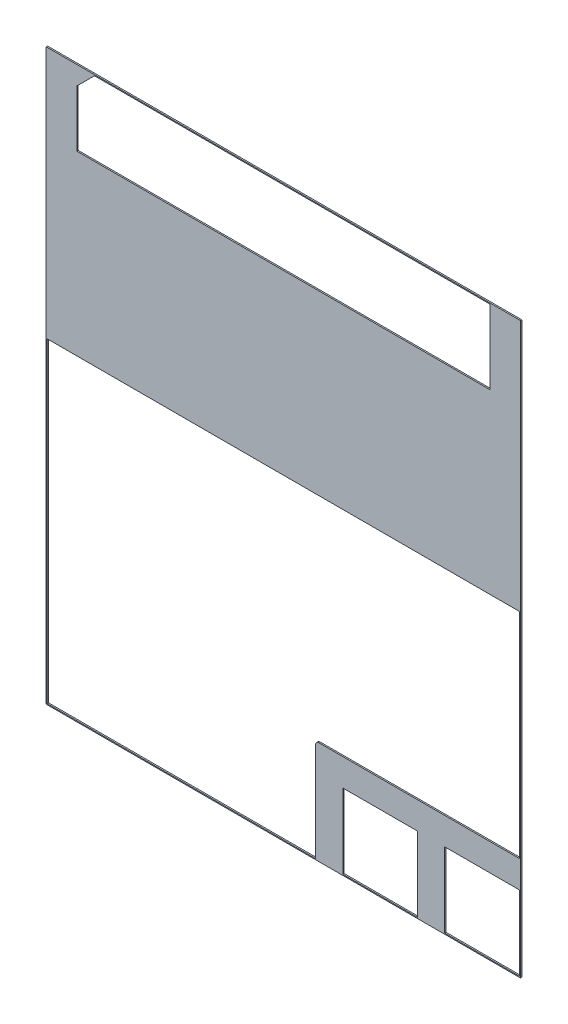
ISO-10303-21;
HEADER;
FILE_DESCRIPTION(('STEP AP214'),'2;1');
FILE_NAME('part.step','',(''),(''),'','','');
FILE_SCHEMA(('AUTOMOTIVE_DESIGN { 1 0 10303 214 1 1 1 1 }'));
ENDSEC;
DATA;
#1=APPLICATION_CONTEXT('core data for automotive mechanical design processes');
#2=APPLICATION_PROTOCOL_DEFINITION('international standard','automotive_design',2000,#1);
#3=PRODUCT_CONTEXT('',#1,'mechanical');
#4=PRODUCT('Part','Part','',(#3));
#5=PRODUCT_RELATED_PRODUCT_CATEGORY('part','',(#4));
#6=PRODUCT_DEFINITION_FORMATION('','',#4);
#7=PRODUCT_DEFINITION_CONTEXT('part definition',#1,'design');
#8=PRODUCT_DEFINITION('design','',#6,#7);
#9=PRODUCT_DEFINITION_SHAPE('','',#8);
#10=(LENGTH_UNIT() NAMED_UNIT(*) SI_UNIT(.MILLI.,.METRE.));
#11=(NAMED_UNIT(*) PLANE_ANGLE_UNIT() SI_UNIT($,.RADIAN.));
#12=(NAMED_UNIT(*) SI_UNIT($,.STERADIAN.) SOLID_ANGLE_UNIT());
#13=UNCERTAINTY_MEASURE_WITH_UNIT(LENGTH_MEASURE(1.E-05),#10,'distance_accuracy_value','');
#14=(GEOMETRIC_REPRESENTATION_CONTEXT(3) GLOBAL_UNCERTAINTY_ASSIGNED_CONTEXT((#13)) GLOBAL_UNIT_ASSIGNED_CONTEXT((#10,
#11,#12)) REPRESENTATION_CONTEXT('',''));
#15=CARTESIAN_POINT('',(0.,0.,0.));
#16=DIRECTION('',(0.,0.,1.));
#17=DIRECTION('',(1.,0.,0.));
#18=AXIS2_PLACEMENT_3D('',#15,#16,#17);
#19=CARTESIAN_POINT('',(0.,0.,0.));
#20=DIRECTION('',(0.,0.,1.));
#21=DIRECTION('',(1.,0.,0.));
#22=AXIS2_PLACEMENT_3D('',#19,#20,#21);
#23=PLANE('',#22);
#24=DIRECTION('',(0.,-1.,0.));
#25=VECTOR('',#24,1.);
#26=CARTESIAN_POINT('',(6.70499999999966,0.015,0.));
#27=LINE('',#26,#25);
#28=CARTESIAN_POINT('',(6.70499999999965,1.115,0.));
#29=VERTEX_POINT('',#28);
#30=CARTESIAN_POINT('',(6.70499999999965,0.015,0.));
#31=VERTEX_POINT('',#30);
#32=EDGE_CURVE('E324',#29,#31,#27,.T.);
#33=ORIENTED_EDGE('',*,*,#32,.F.);
#34=DIRECTION('',(1.,0.,0.));
#35=VECTOR('',#34,1.);
#36=CARTESIAN_POINT('',(6.70499999999965,1.11500000000001,0.));
#37=LINE('',#36,#35);
#38=CARTESIAN_POINT('',(5.60500000000075,1.115,0.));
#39=VERTEX_POINT('',#38);
#40=EDGE_CURVE('E310',#39,#29,#37,.T.);
#41=ORIENTED_EDGE('',*,*,#40,.F.);
#42=DIRECTION('',(0.,1.,0.));
#43=VECTOR('',#42,1.);
#44=CARTESIAN_POINT('',(5.60500000000075,1.115,0.));
#45=LINE('',#44,#43);
#46=CARTESIAN_POINT('',(5.60500000000075,0.0149999999999986,0.));
#47=VERTEX_POINT('',#46);
#48=EDGE_CURVE('E316',#47,#39,#45,.T.);
#49=ORIENTED_EDGE('',*,*,#48,.F.);
#50=DIRECTION('',(-1.,0.,0.));
#51=VECTOR('',#50,1.);
#52=CARTESIAN_POINT('',(5.60500000000075,0.0149999999999973,0.));
#53=LINE('',#52,#51);
#54=EDGE_CURVE('E321',#31,#47,#53,.T.);
#55=ORIENTED_EDGE('',*,*,#54,.F.);
#56=EDGE_LOOP('',(#33,#41,#49,#55));
#57=FACE_BOUND('',#56,.T.);
#58=DIRECTION('',(0.,-1.,0.));
#59=VECTOR('',#58,1.);
#60=CARTESIAN_POINT('',(5.20499999999942,0.015,0.));
#61=LINE('',#60,#59);
#62=CARTESIAN_POINT('',(5.2049999999994,1.115,0.));
#63=VERTEX_POINT('',#62);
#64=CARTESIAN_POINT('',(5.20499999999941,0.015,0.));
#65=VERTEX_POINT('',#64);
#66=EDGE_CURVE('E203',#63,#65,#61,.T.);
#67=ORIENTED_EDGE('',*,*,#66,.F.);
#68=DIRECTION('',(1.,0.,0.));
#69=VECTOR('',#68,1.);
#70=CARTESIAN_POINT('',(5.2049999999994,1.11500000000001,0.));
#71=LINE('',#70,#69);
#72=CARTESIAN_POINT('',(4.10500000000051,1.115,0.));
#73=VERTEX_POINT('',#72);
#74=EDGE_CURVE('E363',#73,#63,#71,.T.);
#75=ORIENTED_EDGE('',*,*,#74,.F.);
#76=DIRECTION('',(0.,1.,0.));
#77=VECTOR('',#76,1.);
#78=CARTESIAN_POINT('',(4.10500000000051,1.115,0.));
#79=LINE('',#78,#77);
#80=CARTESIAN_POINT('',(4.10500000000051,0.0149999999999986,0.));
#81=VERTEX_POINT('',#80);
#82=EDGE_CURVE('E369',#81,#73,#79,.T.);
#83=ORIENTED_EDGE('',*,*,#82,.F.);
#84=DIRECTION('',(-1.,0.,0.));
#85=VECTOR('',#84,1.);
#86=CARTESIAN_POINT('',(4.10500000000051,0.0149999999999973,0.));
#87=LINE('',#86,#85);
#88=EDGE_CURVE('E374',#65,#81,#87,.T.);
#89=ORIENTED_EDGE('',*,*,#88,.F.);
#90=EDGE_LOOP('',(#67,#75,#83,#89));
#91=FACE_BOUND('',#90,.T.);
#92=DIRECTION('',(-1.,0.,0.));
#93=VECTOR('',#92,1.);
#94=CARTESIAN_POINT('',(-0.259999999999676,0.,0.));
#95=LINE('',#94,#93);
#96=CARTESIAN_POINT('',(6.72000000107223,0.,0.));
#97=VERTEX_POINT('',#96);
#98=CARTESIAN_POINT('',(-0.259999999999676,0.,0.));
#99=VERTEX_POINT('',#98);
#100=EDGE_CURVE('E230',#97,#99,#95,.T.);
#101=ORIENTED_EDGE('',*,*,#100,.T.);
#102=DIRECTION('',(0.,1.,0.));
#103=VECTOR('',#102,1.);
#104=CARTESIAN_POINT('',(-0.259999999999676,8.38000000170986,0.));
#105=LINE('',#104,#103);
#106=CARTESIAN_POINT('',(-0.259999999999676,8.38000000170986,0.));
#107=VERTEX_POINT('',#106);
#108=EDGE_CURVE('E238',#99,#107,#105,.T.);
#109=ORIENTED_EDGE('',*,*,#108,.T.);
#110=DIRECTION('',(1.,0.,0.));
#111=VECTOR('',#110,1.);
#112=CARTESIAN_POINT('',(6.72000000107223,8.38000000170986,0.));
#113=LINE('',#112,#111);
#114=CARTESIAN_POINT('',(6.72000000107223,8.38000000170986,0.));
#115=VERTEX_POINT('',#114);
#116=EDGE_CURVE('E243',#107,#115,#113,.T.);
#117=ORIENTED_EDGE('',*,*,#116,.T.);
#118=DIRECTION('',(0.,1.,0.));
#119=VECTOR('',#118,1.);
#120=CARTESIAN_POINT('',(6.72000000107223,0.,0.));
#121=LINE('',#120,#119);
#122=EDGE_CURVE('E248',#115,#97,#121,.F.);
#123=ORIENTED_EDGE('',*,*,#122,.T.);
#124=EDGE_LOOP('',(#101,#109,#117,#123));
#125=FACE_BOUND('',#124,.T.);
#126=DIRECTION('',(1.,0.,0.));
#127=VECTOR('',#126,1.);
#128=CARTESIAN_POINT('',(3.75500000107222,1.515,0.));
#129=LINE('',#128,#127);
#130=CARTESIAN_POINT('',(6.70500000000032,1.515,0.));
#131=VERTEX_POINT('',#130);
#132=CARTESIAN_POINT('',(3.75500000107222,1.515,0.));
#133=VERTEX_POINT('',#132);
#134=EDGE_CURVE('E193',#131,#133,#129,.F.);
#135=ORIENTED_EDGE('',*,*,#134,.F.);
#136=DIRECTION('',(0.,1.,0.));
#137=VECTOR('',#136,1.);
#138=CARTESIAN_POINT('',(6.70500000000032,1.515,0.));
#139=LINE('',#138,#137);
#140=CARTESIAN_POINT('',(6.70500000000032,4.66500000150635,0.));
#141=VERTEX_POINT('',#140);
#142=EDGE_CURVE('E220',#141,#131,#139,.F.);
#143=ORIENTED_EDGE('',*,*,#142,.F.);
#144=DIRECTION('',(1.,0.,0.));
#145=VECTOR('',#144,1.);
#146=CARTESIAN_POINT('',(6.70500000000032,4.66500000150635,0.));
#147=LINE('',#146,#145);
#148=CARTESIAN_POINT('',(-0.244999999999676,4.66500000150635,0.));
#149=VERTEX_POINT('',#148);
#150=EDGE_CURVE('E258',#149,#141,#147,.T.);
#151=ORIENTED_EDGE('',*,*,#150,.F.);
#152=DIRECTION('',(0.,1.,0.));
#153=VECTOR('',#152,1.);
#154=CARTESIAN_POINT('',(-0.244999999999676,4.66500000150635,0.));
#155=LINE('',#154,#153);
#156=CARTESIAN_POINT('',(-0.244999999999676,0.0149999999999975,0.));
#157=VERTEX_POINT('',#156);
#158=EDGE_CURVE('E212',#157,#149,#155,.T.);
#159=ORIENTED_EDGE('',*,*,#158,.F.);
#160=DIRECTION('',(-1.,0.,0.));
#161=VECTOR('',#160,1.);
#162=CARTESIAN_POINT('',(-0.244999999999676,0.0149999999999973,0.));
#163=LINE('',#162,#161);
#164=CARTESIAN_POINT('',(3.70500000107223,0.015,0.));
#165=VERTEX_POINT('',#164);
#166=EDGE_CURVE('E181',#165,#157,#163,.T.);
#167=ORIENTED_EDGE('',*,*,#166,.F.);
#168=DIRECTION('',(0.,-1.,0.));
#169=VECTOR('',#168,1.);
#170=CARTESIAN_POINT('',(3.70500000107223,0.015,0.));
#171=LINE('',#170,#169);
#172=CARTESIAN_POINT('',(3.70500000107222,1.465,0.));
#173=VERTEX_POINT('',#172);
#174=EDGE_CURVE('E178',#173,#165,#171,.T.);
#175=ORIENTED_EDGE('',*,*,#174,.F.);
#176=CARTESIAN_POINT('',(3.75500000107222,1.465,0.));
#177=DIRECTION('',(0.,0.,-1.));
#178=DIRECTION('',(-1.,0.,0.));
#179=AXIS2_PLACEMENT_3D('',#176,#177,#178);
#180=CIRCLE('',#179,0.0500000000000001);
#181=EDGE_CURVE('E20',#133,#173,#180,.F.);
#182=ORIENTED_EDGE('',*,*,#181,.F.);
#183=EDGE_LOOP('',(#135,#143,#151,#159,#167,#175,#182));
#184=FACE_BOUND('',#183,.T.);
#185=DIRECTION('',(0.,1.,0.));
#186=VECTOR('',#185,1.);
#187=CARTESIAN_POINT('',(0.189999980214994,7.27500000170747,0.));
#188=LINE('',#187,#186);
#189=CARTESIAN_POINT('',(0.189999980214994,7.27500000170747,0.));
#190=VERTEX_POINT('',#189);
#191=CARTESIAN_POINT('',(0.189999980214994,8.10500000170897,0.));
#192=VERTEX_POINT('',#191);
#193=EDGE_CURVE('E354',#190,#192,#188,.T.);
#194=ORIENTED_EDGE('',*,*,#193,.F.);
#195=DIRECTION('',(1.,0.,0.));
#196=VECTOR('',#195,1.);
#197=CARTESIAN_POINT('',(6.27000002085724,7.27500000170747,0.));
#198=LINE('',#197,#196);
#199=CARTESIAN_POINT('',(6.27000002085724,7.27500000170747,0.));
#200=VERTEX_POINT('',#199);
#201=EDGE_CURVE('E333',#200,#190,#198,.F.);
#202=ORIENTED_EDGE('',*,*,#201,.F.);
#203=DIRECTION('',(0.,1.,0.));
#204=VECTOR('',#203,1.);
#205=CARTESIAN_POINT('',(6.27000002085724,8.36500000170939,0.));
#206=LINE('',#205,#204);
#207=CARTESIAN_POINT('',(6.27000002085724,8.36500000170939,0.));
#208=VERTEX_POINT('',#207);
#209=EDGE_CURVE('E339',#208,#200,#206,.F.);
#210=ORIENTED_EDGE('',*,*,#209,.F.);
#211=DIRECTION('',(1.,0.,0.));
#212=VECTOR('',#211,1.);
#213=CARTESIAN_POINT('',(0.449999980215416,8.36500000170939,0.));
#214=LINE('',#213,#212);
#215=CARTESIAN_POINT('',(0.449999980215416,8.36500000170939,0.));
#216=VERTEX_POINT('',#215);
#217=EDGE_CURVE('E345',#216,#208,#214,.T.);
#218=ORIENTED_EDGE('',*,*,#217,.F.);
#219=DIRECTION('',(0.707106781186548,0.707106781186547,0.));
#220=VECTOR('',#219,1.);
#221=CARTESIAN_POINT('',(0.189999980214994,8.10500000170897,0.));
#222=LINE('',#221,#220);
#223=EDGE_CURVE('E351',#192,#216,#222,.T.);
#224=ORIENTED_EDGE('',*,*,#223,.F.);
#225=EDGE_LOOP('',(#194,#202,#210,#218,#224));
#226=FACE_BOUND('',#225,.T.);
#227=ADVANCED_FACE('F17',(#57,#91,#125,#184,#226),#23,.F.);
#228=CARTESIAN_POINT('',(6.72000000107223,0.,0.02));
#229=DIRECTION('',(-1.,0.,0.));
#230=DIRECTION('',(0.,0.,1.));
#231=AXIS2_PLACEMENT_3D('',#228,#229,#230);
#232=PLANE('',#231);
#233=DIRECTION('',(0.,0.,-1.));
#234=VECTOR('',#233,1.);
#235=CARTESIAN_POINT('',(6.72000000107223,8.38000000170986,0.02));
#236=LINE('',#235,#234);
#237=CARTESIAN_POINT('',(6.72000000107223,8.38000000170986,0.02));
#238=VERTEX_POINT('',#237);
#239=EDGE_CURVE('E246',#115,#238,#236,.F.);
#240=ORIENTED_EDGE('',*,*,#239,.T.);
#241=DIRECTION('',(0.,1.,0.));
#242=VECTOR('',#241,1.);
#243=CARTESIAN_POINT('',(6.72000000107223,0.,0.02));
#244=LINE('',#243,#242);
#245=CARTESIAN_POINT('',(6.72000000107223,0.,0.02));
#246=VERTEX_POINT('',#245);
#247=EDGE_CURVE('E303',#246,#238,#244,.T.);
#248=ORIENTED_EDGE('',*,*,#247,.F.);
#249=DIRECTION('',(0.,0.,1.));
#250=VECTOR('',#249,1.);
#251=CARTESIAN_POINT('',(6.72000000107223,0.,0.02));
#252=LINE('',#251,#250);
#253=EDGE_CURVE('E233',#246,#97,#252,.F.);
#254=ORIENTED_EDGE('',*,*,#253,.T.);
#255=ORIENTED_EDGE('',*,*,#122,.F.);
#256=EDGE_LOOP('',(#240,#248,#254,#255));
#257=FACE_BOUND('',#256,.T.);
#258=ADVANCED_FACE('F640',(#257),#232,.F.);
#259=CARTESIAN_POINT('',(6.72000000107223,8.38000000170986,0.02));
#260=DIRECTION('',(0.,-1.,0.));
#261=DIRECTION('',(0.,0.,-1.));
#262=AXIS2_PLACEMENT_3D('',#259,#260,#261);
#263=PLANE('',#262);
#264=DIRECTION('',(0.,0.,-1.));
#265=VECTOR('',#264,1.);
#266=CARTESIAN_POINT('',(-0.259999999999676,8.38000000170986,0.02));
#267=LINE('',#266,#265);
#268=CARTESIAN_POINT('',(-0.259999999999676,8.38000000170986,0.02));
#269=VERTEX_POINT('',#268);
#270=EDGE_CURVE('E241',#107,#269,#267,.F.);
#271=ORIENTED_EDGE('',*,*,#270,.T.);
#272=DIRECTION('',(1.,0.,0.));
#273=VECTOR('',#272,1.);
#274=CARTESIAN_POINT('',(0.,8.38000000170986,0.02));
#275=LINE('',#274,#273);
#276=EDGE_CURVE('E300',#238,#269,#275,.F.);
#277=ORIENTED_EDGE('',*,*,#276,.F.);
#278=ORIENTED_EDGE('',*,*,#239,.F.);
#279=ORIENTED_EDGE('',*,*,#116,.F.);
#280=EDGE_LOOP('',(#271,#277,#278,#279));
#281=FACE_BOUND('',#280,.T.);
#282=ADVANCED_FACE('F631',(#281),#263,.F.);
#283=CARTESIAN_POINT('',(-0.259999999999676,8.38000000170986,0.02));
#284=DIRECTION('',(1.,0.,0.));
#285=DIRECTION('',(0.,0.,-1.));
#286=AXIS2_PLACEMENT_3D('',#283,#284,#285);
#287=PLANE('',#286);
#288=DIRECTION('',(0.,0.,1.));
#289=VECTOR('',#288,1.);
#290=CARTESIAN_POINT('',(-0.259999999999676,0.,0.02));
#291=LINE('',#290,#289);
#292=CARTESIAN_POINT('',(-0.259999999999676,0.,0.02));
#293=VERTEX_POINT('',#292);
#294=EDGE_CURVE('E236',#99,#293,#291,.T.);
#295=ORIENTED_EDGE('',*,*,#294,.T.);
#296=DIRECTION('',(0.,1.,0.));
#297=VECTOR('',#296,1.);
#298=CARTESIAN_POINT('',(-0.259999999999676,0.,0.02));
#299=LINE('',#298,#297);
#300=EDGE_CURVE('E291',#269,#293,#299,.F.);
#301=ORIENTED_EDGE('',*,*,#300,.F.);
#302=ORIENTED_EDGE('',*,*,#270,.F.);
#303=ORIENTED_EDGE('',*,*,#108,.F.);
#304=EDGE_LOOP('',(#295,#301,#302,#303));
#305=FACE_BOUND('',#304,.T.);
#306=ADVANCED_FACE('F622',(#305),#287,.F.);
#307=CARTESIAN_POINT('',(-0.259999999999676,0.,0.02));
#308=DIRECTION('',(0.,1.,0.));
#309=DIRECTION('',(-1.,0.,0.));
#310=AXIS2_PLACEMENT_3D('',#307,#308,#309);
#311=PLANE('',#310);
#312=ORIENTED_EDGE('',*,*,#253,.F.);
#313=DIRECTION('',(1.,0.,0.));
#314=VECTOR('',#313,1.);
#315=CARTESIAN_POINT('',(0.,0.,0.02));
#316=LINE('',#315,#314);
#317=EDGE_CURVE('E288',#293,#246,#316,.T.);
#318=ORIENTED_EDGE('',*,*,#317,.F.);
#319=ORIENTED_EDGE('',*,*,#294,.F.);
#320=ORIENTED_EDGE('',*,*,#100,.F.);
#321=EDGE_LOOP('',(#312,#318,#319,#320));
#322=FACE_BOUND('',#321,.T.);
#323=ADVANCED_FACE('F614',(#322),#311,.F.);
#324=CARTESIAN_POINT('',(3.75500000107222,1.515,0.02));
#325=DIRECTION('',(0.,1.,0.));
#326=DIRECTION('',(0.,0.,1.));
#327=AXIS2_PLACEMENT_3D('',#324,#325,#326);
#328=PLANE('',#327);
#329=DIRECTION('',(1.,0.,0.));
#330=VECTOR('',#329,1.);
#331=CARTESIAN_POINT('',(0.,1.515,0.02));
#332=LINE('',#331,#330);
#333=CARTESIAN_POINT('',(6.70500000000032,1.515,0.02));
#334=VERTEX_POINT('',#333);
#335=CARTESIAN_POINT('',(3.75500000107222,1.515,0.02));
#336=VERTEX_POINT('',#335);
#337=EDGE_CURVE('E284',#334,#336,#332,.F.);
#338=ORIENTED_EDGE('',*,*,#337,.F.);
#339=DIRECTION('',(0.,0.,1.));
#340=VECTOR('',#339,1.);
#341=CARTESIAN_POINT('',(6.70500000000032,1.515,0.02));
#342=LINE('',#341,#340);
#343=EDGE_CURVE('E216',#131,#334,#342,.T.);
#344=ORIENTED_EDGE('',*,*,#343,.F.);
#345=ORIENTED_EDGE('',*,*,#134,.T.);
#346=DIRECTION('',(0.,0.,-1.));
#347=VECTOR('',#346,1.);
#348=CARTESIAN_POINT('',(3.75500000107222,1.515,0.02));
#349=LINE('',#348,#347);
#350=EDGE_CURVE('E186',#336,#133,#349,.T.);
#351=ORIENTED_EDGE('',*,*,#350,.F.);
#352=EDGE_LOOP('',(#338,#344,#345,#351));
#353=FACE_BOUND('',#352,.T.);
#354=ADVANCED_FACE('F415',(#353),#328,.T.);
#355=CARTESIAN_POINT('',(3.75500000107222,1.465,0.02));
#356=DIRECTION('',(0.,0.,-1.));
#357=DIRECTION('',(-1.,0.,0.));
#358=AXIS2_PLACEMENT_3D('',#355,#356,#357);
#359=CYLINDRICAL_SURFACE('',#358,0.0500000000000001);
#360=CARTESIAN_POINT('',(3.75500000107222,1.465,0.02));
#361=DIRECTION('',(0.,0.,-1.));
#362=DIRECTION('',(-1.,0.,0.));
#363=AXIS2_PLACEMENT_3D('',#360,#361,#362);
#364=CIRCLE('',#363,0.0500000000000001);
#365=CARTESIAN_POINT('',(3.70500000107222,1.465,0.02));
#366=VERTEX_POINT('',#365);
#367=EDGE_CURVE('E283',#336,#366,#364,.F.);
#368=ORIENTED_EDGE('',*,*,#367,.F.);
#369=ORIENTED_EDGE('',*,*,#350,.T.);
#370=ORIENTED_EDGE('',*,*,#181,.T.);
#371=DIRECTION('',(0.,0.,1.));
#372=VECTOR('',#371,1.);
#373=CARTESIAN_POINT('',(3.70500000107222,1.465,0.02));
#374=LINE('',#373,#372);
#375=EDGE_CURVE('E185',#366,#173,#374,.F.);
#376=ORIENTED_EDGE('',*,*,#375,.F.);
#377=EDGE_LOOP('',(#368,#369,#370,#376));
#378=FACE_BOUND('',#377,.T.);
#379=ADVANCED_FACE('F191',(#378),#359,.T.);
#380=CARTESIAN_POINT('',(3.70500000107223,0.015,0.02));
#381=DIRECTION('',(-1.,0.,0.));
#382=DIRECTION('',(0.,-1.,0.));
#383=AXIS2_PLACEMENT_3D('',#380,#381,#382);
#384=PLANE('',#383);
#385=DIRECTION('',(0.,1.,0.));
#386=VECTOR('',#385,1.);
#387=CARTESIAN_POINT('',(3.70500000107222,0.,0.02));
#388=LINE('',#387,#386);
#389=CARTESIAN_POINT('',(3.70500000107222,0.015,0.02));
#390=VERTEX_POINT('',#389);
#391=EDGE_CURVE('E196',#366,#390,#388,.F.);
#392=ORIENTED_EDGE('',*,*,#391,.F.);
#393=ORIENTED_EDGE('',*,*,#375,.T.);
#394=ORIENTED_EDGE('',*,*,#174,.T.);
#395=DIRECTION('',(0.,0.,1.));
#396=VECTOR('',#395,1.);
#397=CARTESIAN_POINT('',(3.70500000107223,0.015,0.02));
#398=LINE('',#397,#396);
#399=EDGE_CURVE('E199',#390,#165,#398,.F.);
#400=ORIENTED_EDGE('',*,*,#399,.F.);
#401=EDGE_LOOP('',(#392,#393,#394,#400));
#402=FACE_BOUND('',#401,.T.);
#403=ADVANCED_FACE('F194',(#402),#384,.T.);
#404=CARTESIAN_POINT('',(-0.244999999999676,0.0149999999999973,0.02));
#405=DIRECTION('',(0.,1.,0.));
#406=DIRECTION('',(-1.,0.,0.));
#407=AXIS2_PLACEMENT_3D('',#404,#405,#406);
#408=PLANE('',#407);
#409=DIRECTION('',(1.,0.,0.));
#410=VECTOR('',#409,1.);
#411=CARTESIAN_POINT('',(0.,0.015,0.02));
#412=LINE('',#411,#410);
#413=CARTESIAN_POINT('',(-0.244999999999676,0.014999999999998,0.02));
#414=VERTEX_POINT('',#413);
#415=EDGE_CURVE('E205',#390,#414,#412,.F.);
#416=ORIENTED_EDGE('',*,*,#415,.F.);
#417=ORIENTED_EDGE('',*,*,#399,.T.);
#418=ORIENTED_EDGE('',*,*,#166,.T.);
#419=DIRECTION('',(0.,0.,-1.));
#420=VECTOR('',#419,1.);
#421=CARTESIAN_POINT('',(-0.244999999999676,0.0149999999999977,0.02));
#422=LINE('',#421,#420);
#423=EDGE_CURVE('E261',#414,#157,#422,.T.);
#424=ORIENTED_EDGE('',*,*,#423,.F.);
#425=EDGE_LOOP('',(#416,#417,#418,#424));
#426=FACE_BOUND('',#425,.T.);
#427=ADVANCED_FACE('F417',(#426),#408,.T.);
#428=CARTESIAN_POINT('',(-0.244999999999676,4.66500000150635,0.02));
#429=DIRECTION('',(1.,0.,0.));
#430=DIRECTION('',(0.,0.,-1.));
#431=AXIS2_PLACEMENT_3D('',#428,#429,#430);
#432=PLANE('',#431);
#433=DIRECTION('',(0.,1.,0.));
#434=VECTOR('',#433,1.);
#435=CARTESIAN_POINT('',(-0.244999999999676,0.,0.02));
#436=LINE('',#435,#434);
#437=CARTESIAN_POINT('',(-0.244999999999676,4.66500000150635,0.02));
#438=VERTEX_POINT('',#437);
#439=EDGE_CURVE('E208',#414,#438,#436,.T.);
#440=ORIENTED_EDGE('',*,*,#439,.F.);
#441=ORIENTED_EDGE('',*,*,#423,.T.);
#442=ORIENTED_EDGE('',*,*,#158,.T.);
#443=DIRECTION('',(0.,0.,-1.));
#444=VECTOR('',#443,1.);
#445=CARTESIAN_POINT('',(-0.244999999999676,4.66500000150635,0.02));
#446=LINE('',#445,#444);
#447=EDGE_CURVE('E255',#438,#149,#446,.T.);
#448=ORIENTED_EDGE('',*,*,#447,.F.);
#449=EDGE_LOOP('',(#440,#441,#442,#448));
#450=FACE_BOUND('',#449,.T.);
#451=ADVANCED_FACE('F407',(#450),#432,.T.);
#452=CARTESIAN_POINT('',(6.70500000000032,4.66500000150635,0.02));
#453=DIRECTION('',(0.,-1.,0.));
#454=DIRECTION('',(0.,0.,-1.));
#455=AXIS2_PLACEMENT_3D('',#452,#453,#454);
#456=PLANE('',#455);
#457=DIRECTION('',(1.,0.,0.));
#458=VECTOR('',#457,1.);
#459=CARTESIAN_POINT('',(0.,4.66500000150635,0.02));
#460=LINE('',#459,#458);
#461=CARTESIAN_POINT('',(6.70500000000032,4.66500000150635,0.02));
#462=VERTEX_POINT('',#461);
#463=EDGE_CURVE('E227',#438,#462,#460,.T.);
#464=ORIENTED_EDGE('',*,*,#463,.F.);
#465=ORIENTED_EDGE('',*,*,#447,.T.);
#466=ORIENTED_EDGE('',*,*,#150,.T.);
#467=DIRECTION('',(0.,0.,1.));
#468=VECTOR('',#467,1.);
#469=CARTESIAN_POINT('',(6.70500000000032,4.66500000150635,0.02));
#470=LINE('',#469,#468);
#471=EDGE_CURVE('E219',#462,#141,#470,.F.);
#472=ORIENTED_EDGE('',*,*,#471,.F.);
#473=EDGE_LOOP('',(#464,#465,#466,#472));
#474=FACE_BOUND('',#473,.T.);
#475=ADVANCED_FACE('F409',(#474),#456,.T.);
#476=CARTESIAN_POINT('',(6.70500000000032,1.515,0.02));
#477=DIRECTION('',(-1.,0.,0.));
#478=DIRECTION('',(0.,0.,1.));
#479=AXIS2_PLACEMENT_3D('',#476,#477,#478);
#480=PLANE('',#479);
#481=DIRECTION('',(0.,1.,0.));
#482=VECTOR('',#481,1.);
#483=CARTESIAN_POINT('',(6.70500000000032,0.,0.02));
#484=LINE('',#483,#482);
#485=EDGE_CURVE('E223',#462,#334,#484,.F.);
#486=ORIENTED_EDGE('',*,*,#485,.F.);
#487=ORIENTED_EDGE('',*,*,#471,.T.);
#488=ORIENTED_EDGE('',*,*,#142,.T.);
#489=ORIENTED_EDGE('',*,*,#343,.T.);
#490=EDGE_LOOP('',(#486,#487,#488,#489));
#491=FACE_BOUND('',#490,.T.);
#492=ADVANCED_FACE('F412',(#491),#480,.T.);
#493=CARTESIAN_POINT('',(5.20499999999942,0.015,0.02));
#494=DIRECTION('',(-1.,0.,0.));
#495=DIRECTION('',(0.,-1.,0.));
#496=AXIS2_PLACEMENT_3D('',#493,#494,#495);
#497=PLANE('',#496);
#498=DIRECTION('',(0.,1.,0.));
#499=VECTOR('',#498,1.);
#500=CARTESIAN_POINT('',(5.2049999999994,0.,0.02));
#501=LINE('',#500,#499);
#502=CARTESIAN_POINT('',(5.2049999999994,1.11500000000001,0.02));
#503=VERTEX_POINT('',#502);
#504=CARTESIAN_POINT('',(5.20499999999941,0.015,0.02));
#505=VERTEX_POINT('',#504);
#506=EDGE_CURVE('E226',#503,#505,#501,.F.);
#507=ORIENTED_EDGE('',*,*,#506,.F.);
#508=DIRECTION('',(0.,0.,1.));
#509=VECTOR('',#508,1.);
#510=CARTESIAN_POINT('',(5.2049999999994,1.11500000000001,0.02));
#511=LINE('',#510,#509);
#512=EDGE_CURVE('E360',#63,#503,#511,.T.);
#513=ORIENTED_EDGE('',*,*,#512,.F.);
#514=ORIENTED_EDGE('',*,*,#66,.T.);
#515=DIRECTION('',(0.,0.,1.));
#516=VECTOR('',#515,1.);
#517=CARTESIAN_POINT('',(5.20499999999942,0.015,0.02));
#518=LINE('',#517,#516);
#519=EDGE_CURVE('E372',#505,#65,#518,.F.);
#520=ORIENTED_EDGE('',*,*,#519,.F.);
#521=EDGE_LOOP('',(#507,#513,#514,#520));
#522=FACE_BOUND('',#521,.T.);
#523=ADVANCED_FACE('F380',(#522),#497,.T.);
#524=CARTESIAN_POINT('',(4.10500000000051,0.0149999999999973,0.02));
#525=DIRECTION('',(0.,1.,0.));
#526=DIRECTION('',(-1.,0.,0.));
#527=AXIS2_PLACEMENT_3D('',#524,#525,#526);
#528=PLANE('',#527);
#529=DIRECTION('',(1.,0.,0.));
#530=VECTOR('',#529,1.);
#531=CARTESIAN_POINT('',(0.,0.015,0.02));
#532=LINE('',#531,#530);
#533=CARTESIAN_POINT('',(4.10500000000051,0.0149999999999979,0.02));
#534=VERTEX_POINT('',#533);
#535=EDGE_CURVE('E385',#505,#534,#532,.F.);
#536=ORIENTED_EDGE('',*,*,#535,.F.);
#537=ORIENTED_EDGE('',*,*,#519,.T.);
#538=ORIENTED_EDGE('',*,*,#88,.T.);
#539=DIRECTION('',(0.,0.,-1.));
#540=VECTOR('',#539,1.);
#541=CARTESIAN_POINT('',(4.10500000000051,0.0149999999999972,0.02));
#542=LINE('',#541,#540);
#543=EDGE_CURVE('E366',#534,#81,#542,.T.);
#544=ORIENTED_EDGE('',*,*,#543,.F.);
#545=EDGE_LOOP('',(#536,#537,#538,#544));
#546=FACE_BOUND('',#545,.T.);
#547=ADVANCED_FACE('F383',(#546),#528,.T.);
#548=CARTESIAN_POINT('',(4.10500000000051,1.115,0.02));
#549=DIRECTION('',(1.,0.,0.));
#550=DIRECTION('',(0.,0.,-1.));
#551=AXIS2_PLACEMENT_3D('',#548,#549,#550);
#552=PLANE('',#551);
#553=DIRECTION('',(0.,1.,0.));
#554=VECTOR('',#553,1.);
#555=CARTESIAN_POINT('',(4.10500000000051,0.,0.02));
#556=LINE('',#555,#554);
#557=CARTESIAN_POINT('',(4.10500000000051,1.115,0.02));
#558=VERTEX_POINT('',#557);
#559=EDGE_CURVE('E390',#534,#558,#556,.T.);
#560=ORIENTED_EDGE('',*,*,#559,.F.);
#561=ORIENTED_EDGE('',*,*,#543,.T.);
#562=ORIENTED_EDGE('',*,*,#82,.T.);
#563=DIRECTION('',(0.,0.,1.));
#564=VECTOR('',#563,1.);
#565=CARTESIAN_POINT('',(4.10500000000051,1.115,0.02));
#566=LINE('',#565,#564);
#567=EDGE_CURVE('E357',#558,#73,#566,.F.);
#568=ORIENTED_EDGE('',*,*,#567,.F.);
#569=EDGE_LOOP('',(#560,#561,#562,#568));
#570=FACE_BOUND('',#569,.T.);
#571=ADVANCED_FACE('F473',(#570),#552,.T.);
#572=CARTESIAN_POINT('',(5.2049999999994,1.11500000000001,0.02));
#573=DIRECTION('',(0.,-1.,0.));
#574=DIRECTION('',(1.,0.,0.));
#575=AXIS2_PLACEMENT_3D('',#572,#573,#574);
#576=PLANE('',#575);
#577=DIRECTION('',(1.,0.,0.));
#578=VECTOR('',#577,1.);
#579=CARTESIAN_POINT('',(0.,1.115,0.02));
#580=LINE('',#579,#578);
#581=EDGE_CURVE('E395',#558,#503,#580,.T.);
#582=ORIENTED_EDGE('',*,*,#581,.F.);
#583=ORIENTED_EDGE('',*,*,#567,.T.);
#584=ORIENTED_EDGE('',*,*,#74,.T.);
#585=ORIENTED_EDGE('',*,*,#512,.T.);
#586=EDGE_LOOP('',(#582,#583,#584,#585));
#587=FACE_BOUND('',#586,.T.);
#588=ADVANCED_FACE('F469',(#587),#576,.T.);
#589=CARTESIAN_POINT('',(0.189999980214994,7.27500000170747,0.02));
#590=DIRECTION('',(1.,0.,0.));
#591=DIRECTION('',(0.,0.,-1.));
#592=AXIS2_PLACEMENT_3D('',#589,#590,#591);
#593=PLANE('',#592);
#594=DIRECTION('',(0.,1.,0.));
#595=VECTOR('',#594,1.);
#596=CARTESIAN_POINT('',(0.189999980214994,0.,0.02));
#597=LINE('',#596,#595);
#598=CARTESIAN_POINT('',(0.189999980214994,7.27500000170747,0.02));
#599=VERTEX_POINT('',#598);
#600=CARTESIAN_POINT('',(0.189999980214994,8.10500000170897,0.02));
#601=VERTEX_POINT('',#600);
#602=EDGE_CURVE('E701',#599,#601,#597,.T.);
#603=ORIENTED_EDGE('',*,*,#602,.F.);
#604=DIRECTION('',(0.,0.,1.));
#605=VECTOR('',#604,1.);
#606=CARTESIAN_POINT('',(0.189999980214994,7.27500000170747,0.02));
#607=LINE('',#606,#605);
#608=EDGE_CURVE('E330',#190,#599,#607,.T.);
#609=ORIENTED_EDGE('',*,*,#608,.F.);
#610=ORIENTED_EDGE('',*,*,#193,.T.);
#611=DIRECTION('',(0.,0.,1.));
#612=VECTOR('',#611,1.);
#613=CARTESIAN_POINT('',(0.189999980214994,8.10500000170897,0.02));
#614=LINE('',#613,#612);
#615=EDGE_CURVE('E348',#601,#192,#614,.F.);
#616=ORIENTED_EDGE('',*,*,#615,.F.);
#617=EDGE_LOOP('',(#603,#609,#610,#616));
#618=FACE_BOUND('',#617,.T.);
#619=ADVANCED_FACE('F465',(#618),#593,.T.);
#620=CARTESIAN_POINT('',(0.189999980214994,8.10500000170897,0.02));
#621=DIRECTION('',(0.707106781186547,-0.707106781186548,0.));
#622=DIRECTION('',(0.707106781186548,0.707106781186547,0.));
#623=AXIS2_PLACEMENT_3D('',#620,#621,#622);
#624=PLANE('',#623);
#625=DIRECTION('',(0.707106781186548,0.707106781186547,0.));
#626=VECTOR('',#625,1.);
#627=CARTESIAN_POINT('',(0.189999980214994,8.10500000170897,0.02));
#628=LINE('',#627,#626);
#629=CARTESIAN_POINT('',(0.449999980215416,8.36500000170939,0.02));
#630=VERTEX_POINT('',#629);
#631=EDGE_CURVE('E698',#601,#630,#628,.T.);
#632=ORIENTED_EDGE('',*,*,#631,.F.);
#633=ORIENTED_EDGE('',*,*,#615,.T.);
#634=ORIENTED_EDGE('',*,*,#223,.T.);
#635=DIRECTION('',(0.,0.,-1.));
#636=VECTOR('',#635,1.);
#637=CARTESIAN_POINT('',(0.449999980215416,8.36500000170939,0.02));
#638=LINE('',#637,#636);
#639=EDGE_CURVE('E342',#630,#216,#638,.T.);
#640=ORIENTED_EDGE('',*,*,#639,.F.);
#641=EDGE_LOOP('',(#632,#633,#634,#640));
#642=FACE_BOUND('',#641,.T.);
#643=ADVANCED_FACE('F461',(#642),#624,.T.);
#644=CARTESIAN_POINT('',(0.449999980215416,8.36500000170939,0.02));
#645=DIRECTION('',(0.,-1.,0.));
#646=DIRECTION('',(0.,0.,-1.));
#647=AXIS2_PLACEMENT_3D('',#644,#645,#646);
#648=PLANE('',#647);
#649=DIRECTION('',(1.,0.,0.));
#650=VECTOR('',#649,1.);
#651=CARTESIAN_POINT('',(0.,8.36500000170939,0.02));
#652=LINE('',#651,#650);
#653=CARTESIAN_POINT('',(6.27000002085724,8.36500000170939,0.02));
#654=VERTEX_POINT('',#653);
#655=EDGE_CURVE('E695',#630,#654,#652,.T.);
#656=ORIENTED_EDGE('',*,*,#655,.F.);
#657=ORIENTED_EDGE('',*,*,#639,.T.);
#658=ORIENTED_EDGE('',*,*,#217,.T.);
#659=DIRECTION('',(0.,0.,1.));
#660=VECTOR('',#659,1.);
#661=CARTESIAN_POINT('',(6.27000002085724,8.36500000170939,0.02));
#662=LINE('',#661,#660);
#663=EDGE_CURVE('E336',#654,#208,#662,.F.);
#664=ORIENTED_EDGE('',*,*,#663,.F.);
#665=EDGE_LOOP('',(#656,#657,#658,#664));
#666=FACE_BOUND('',#665,.T.);
#667=ADVANCED_FACE('F457',(#666),#648,.T.);
#668=CARTESIAN_POINT('',(6.27000002085724,8.36500000170939,0.02));
#669=DIRECTION('',(-1.,0.,0.));
#670=DIRECTION('',(0.,0.,1.));
#671=AXIS2_PLACEMENT_3D('',#668,#669,#670);
#672=PLANE('',#671);
#673=DIRECTION('',(0.,1.,0.));
#674=VECTOR('',#673,1.);
#675=CARTESIAN_POINT('',(6.27000002085724,0.,0.02));
#676=LINE('',#675,#674);
#677=CARTESIAN_POINT('',(6.27000002085724,7.27500000170747,0.02));
#678=VERTEX_POINT('',#677);
#679=EDGE_CURVE('E692',#654,#678,#676,.F.);
#680=ORIENTED_EDGE('',*,*,#679,.F.);
#681=ORIENTED_EDGE('',*,*,#663,.T.);
#682=ORIENTED_EDGE('',*,*,#209,.T.);
#683=DIRECTION('',(0.,0.,1.));
#684=VECTOR('',#683,1.);
#685=CARTESIAN_POINT('',(6.27000002085724,7.27500000170747,0.02));
#686=LINE('',#685,#684);
#687=EDGE_CURVE('E327',#678,#200,#686,.F.);
#688=ORIENTED_EDGE('',*,*,#687,.F.);
#689=EDGE_LOOP('',(#680,#681,#682,#688));
#690=FACE_BOUND('',#689,.T.);
#691=ADVANCED_FACE('F453',(#690),#672,.T.);
#692=CARTESIAN_POINT('',(6.27000002085724,7.27500000170747,0.02));
#693=DIRECTION('',(0.,1.,0.));
#694=DIRECTION('',(0.,0.,1.));
#695=AXIS2_PLACEMENT_3D('',#692,#693,#694);
#696=PLANE('',#695);
#697=DIRECTION('',(1.,0.,0.));
#698=VECTOR('',#697,1.);
#699=CARTESIAN_POINT('',(0.,7.27500000170747,0.02));
#700=LINE('',#699,#698);
#701=EDGE_CURVE('E689',#678,#599,#700,.F.);
#702=ORIENTED_EDGE('',*,*,#701,.F.);
#703=ORIENTED_EDGE('',*,*,#687,.T.);
#704=ORIENTED_EDGE('',*,*,#201,.T.);
#705=ORIENTED_EDGE('',*,*,#608,.T.);
#706=EDGE_LOOP('',(#702,#703,#704,#705));
#707=FACE_BOUND('',#706,.T.);
#708=ADVANCED_FACE('F449',(#707),#696,.T.);
#709=CARTESIAN_POINT('',(6.70499999999966,0.015,0.02));
#710=DIRECTION('',(-1.,0.,0.));
#711=DIRECTION('',(0.,-1.,0.));
#712=AXIS2_PLACEMENT_3D('',#709,#710,#711);
#713=PLANE('',#712);
#714=DIRECTION('',(0.,1.,0.));
#715=VECTOR('',#714,1.);
#716=CARTESIAN_POINT('',(6.70499999999965,0.,0.02));
#717=LINE('',#716,#715);
#718=CARTESIAN_POINT('',(6.70499999999965,1.11500000000001,0.02));
#719=VERTEX_POINT('',#718);
#720=CARTESIAN_POINT('',(6.70499999999965,0.015,0.02));
#721=VERTEX_POINT('',#720);
#722=EDGE_CURVE('E681',#719,#721,#717,.F.);
#723=ORIENTED_EDGE('',*,*,#722,.F.);
#724=DIRECTION('',(0.,0.,1.));
#725=VECTOR('',#724,1.);
#726=CARTESIAN_POINT('',(6.70499999999965,1.11500000000001,0.02));
#727=LINE('',#726,#725);
#728=EDGE_CURVE('E307',#29,#719,#727,.T.);
#729=ORIENTED_EDGE('',*,*,#728,.F.);
#730=ORIENTED_EDGE('',*,*,#32,.T.);
#731=DIRECTION('',(0.,0.,1.));
#732=VECTOR('',#731,1.);
#733=CARTESIAN_POINT('',(6.70499999999966,0.015,0.02));
#734=LINE('',#733,#732);
#735=EDGE_CURVE('E318',#721,#31,#734,.F.);
#736=ORIENTED_EDGE('',*,*,#735,.F.);
#737=EDGE_LOOP('',(#723,#729,#730,#736));
#738=FACE_BOUND('',#737,.T.);
#739=ADVANCED_FACE('F445',(#738),#713,.T.);
#740=CARTESIAN_POINT('',(5.60500000000075,0.0149999999999973,0.02));
#741=DIRECTION('',(0.,1.,0.));
#742=DIRECTION('',(-1.,0.,0.));
#743=AXIS2_PLACEMENT_3D('',#740,#741,#742);
#744=PLANE('',#743);
#745=DIRECTION('',(1.,0.,0.));
#746=VECTOR('',#745,1.);
#747=CARTESIAN_POINT('',(0.,0.015,0.02));
#748=LINE('',#747,#746);
#749=CARTESIAN_POINT('',(5.60500000000075,0.0149999999999979,0.02));
#750=VERTEX_POINT('',#749);
#751=EDGE_CURVE('E684',#721,#750,#748,.F.);
#752=ORIENTED_EDGE('',*,*,#751,.F.);
#753=ORIENTED_EDGE('',*,*,#735,.T.);
#754=ORIENTED_EDGE('',*,*,#54,.T.);
#755=DIRECTION('',(0.,0.,-1.));
#756=VECTOR('',#755,1.);
#757=CARTESIAN_POINT('',(5.60500000000075,0.0149999999999972,0.02));
#758=LINE('',#757,#756);
#759=EDGE_CURVE('E313',#750,#47,#758,.T.);
#760=ORIENTED_EDGE('',*,*,#759,.F.);
#761=EDGE_LOOP('',(#752,#753,#754,#760));
#762=FACE_BOUND('',#761,.T.);
#763=ADVANCED_FACE('F442',(#762),#744,.T.);
#764=CARTESIAN_POINT('',(5.60500000000075,1.115,0.02));
#765=DIRECTION('',(1.,0.,0.));
#766=DIRECTION('',(0.,0.,-1.));
#767=AXIS2_PLACEMENT_3D('',#764,#765,#766);
#768=PLANE('',#767);
#769=DIRECTION('',(0.,1.,0.));
#770=VECTOR('',#769,1.);
#771=CARTESIAN_POINT('',(5.60500000000075,0.,0.02));
#772=LINE('',#771,#770);
#773=CARTESIAN_POINT('',(5.60500000000075,1.115,0.02));
#774=VERTEX_POINT('',#773);
#775=EDGE_CURVE('E26',#750,#774,#772,.T.);
#776=ORIENTED_EDGE('',*,*,#775,.F.);
#777=ORIENTED_EDGE('',*,*,#759,.T.);
#778=ORIENTED_EDGE('',*,*,#48,.T.);
#779=DIRECTION('',(0.,0.,1.));
#780=VECTOR('',#779,1.);
#781=CARTESIAN_POINT('',(5.60500000000075,1.115,0.02));
#782=LINE('',#781,#780);
#783=EDGE_CURVE('E35',#774,#39,#782,.F.);
#784=ORIENTED_EDGE('',*,*,#783,.F.);
#785=EDGE_LOOP('',(#776,#777,#778,#784));
#786=FACE_BOUND('',#785,.T.);
#787=ADVANCED_FACE('F434',(#786),#768,.T.);
#788=CARTESIAN_POINT('',(6.70499999999965,1.11500000000001,0.02));
#789=DIRECTION('',(0.,-1.,0.));
#790=DIRECTION('',(1.,0.,0.));
#791=AXIS2_PLACEMENT_3D('',#788,#789,#790);
#792=PLANE('',#791);
#793=DIRECTION('',(1.,0.,0.));
#794=VECTOR('',#793,1.);
#795=CARTESIAN_POINT('',(0.,1.115,0.02));
#796=LINE('',#795,#794);
#797=EDGE_CURVE('E11',#774,#719,#796,.T.);
#798=ORIENTED_EDGE('',*,*,#797,.F.);
#799=ORIENTED_EDGE('',*,*,#783,.T.);
#800=ORIENTED_EDGE('',*,*,#40,.T.);
#801=ORIENTED_EDGE('',*,*,#728,.T.);
#802=EDGE_LOOP('',(#798,#799,#800,#801));
#803=FACE_BOUND('',#802,.T.);
#804=ADVANCED_FACE('F428',(#803),#792,.T.);
#805=CARTESIAN_POINT('',(0.,0.,0.02));
#806=DIRECTION('',(0.,0.,1.));
#807=DIRECTION('',(1.,0.,0.));
#808=AXIS2_PLACEMENT_3D('',#805,#806,#807);
#809=PLANE('',#808);
#810=ORIENTED_EDGE('',*,*,#775,.T.);
#811=ORIENTED_EDGE('',*,*,#797,.T.);
#812=ORIENTED_EDGE('',*,*,#722,.T.);
#813=ORIENTED_EDGE('',*,*,#751,.T.);
#814=EDGE_LOOP('',(#810,#811,#812,#813));
#815=FACE_BOUND('',#814,.T.);
#816=ORIENTED_EDGE('',*,*,#679,.T.);
#817=ORIENTED_EDGE('',*,*,#701,.T.);
#818=ORIENTED_EDGE('',*,*,#602,.T.);
#819=ORIENTED_EDGE('',*,*,#631,.T.);
#820=ORIENTED_EDGE('',*,*,#655,.T.);
#821=EDGE_LOOP('',(#816,#817,#818,#819,#820));
#822=FACE_BOUND('',#821,.T.);
#823=ORIENTED_EDGE('',*,*,#559,.T.);
#824=ORIENTED_EDGE('',*,*,#581,.T.);
#825=ORIENTED_EDGE('',*,*,#506,.T.);
#826=ORIENTED_EDGE('',*,*,#535,.T.);
#827=EDGE_LOOP('',(#823,#824,#825,#826));
#828=FACE_BOUND('',#827,.T.);
#829=ORIENTED_EDGE('',*,*,#463,.T.);
#830=ORIENTED_EDGE('',*,*,#485,.T.);
#831=ORIENTED_EDGE('',*,*,#337,.T.);
#832=ORIENTED_EDGE('',*,*,#367,.T.);
#833=ORIENTED_EDGE('',*,*,#391,.T.);
#834=ORIENTED_EDGE('',*,*,#415,.T.);
#835=ORIENTED_EDGE('',*,*,#439,.T.);
#836=EDGE_LOOP('',(#829,#830,#831,#832,#833,#834,#835));
#837=FACE_BOUND('',#836,.T.);
#838=ORIENTED_EDGE('',*,*,#300,.T.);
#839=ORIENTED_EDGE('',*,*,#317,.T.);
#840=ORIENTED_EDGE('',*,*,#247,.T.);
#841=ORIENTED_EDGE('',*,*,#276,.T.);
#842=EDGE_LOOP('',(#838,#839,#840,#841));
#843=FACE_BOUND('',#842,.T.);
#844=ADVANCED_FACE('F393',(#815,#822,#828,#837,#843),#809,.T.);
#845=CLOSED_SHELL('',(#227,#258,#282,#306,#323,#354,#379,#403,#427,#451,#475,#492,#523,#547,
#571,#588,#619,#643,#667,#691,#708,#739,#763,#787,#804,#844));
#846=MANIFOLD_SOLID_BREP('B1',#845);
#847=ADVANCED_BREP_SHAPE_REPRESENTATION('',(#18,#846),#14);
#848=SHAPE_DEFINITION_REPRESENTATION(#9,#847);
ENDSEC;
END-ISO-10303-21;
